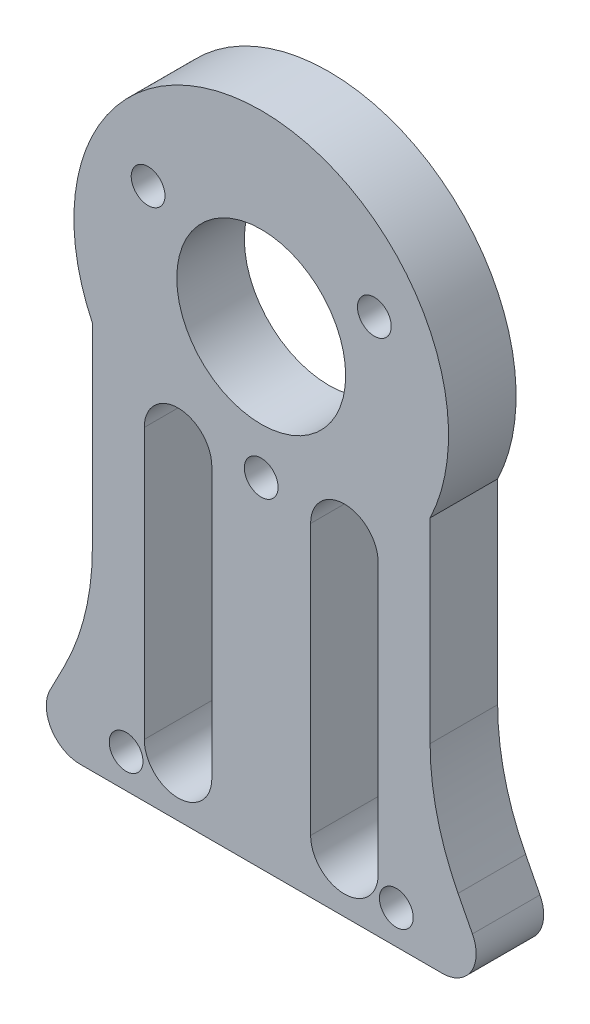
ISO-10303-21;
HEADER;
FILE_DESCRIPTION(('STEP AP214'),'2;1');
FILE_NAME('part.step','',(''),(''),'','','');
FILE_SCHEMA(('AUTOMOTIVE_DESIGN { 1 0 10303 214 1 1 1 1 }'));
ENDSEC;
DATA;
#1=APPLICATION_CONTEXT('core data for automotive mechanical design processes');
#2=APPLICATION_PROTOCOL_DEFINITION('international standard','automotive_design',2000,#1);
#3=PRODUCT_CONTEXT('',#1,'mechanical');
#4=PRODUCT('Part','Part','',(#3));
#5=PRODUCT_RELATED_PRODUCT_CATEGORY('part','',(#4));
#6=PRODUCT_DEFINITION_FORMATION('','',#4);
#7=PRODUCT_DEFINITION_CONTEXT('part definition',#1,'design');
#8=PRODUCT_DEFINITION('design','',#6,#7);
#9=PRODUCT_DEFINITION_SHAPE('','',#8);
#10=(LENGTH_UNIT() NAMED_UNIT(*) SI_UNIT(.MILLI.,.METRE.));
#11=(NAMED_UNIT(*) PLANE_ANGLE_UNIT() SI_UNIT($,.RADIAN.));
#12=(NAMED_UNIT(*) SI_UNIT($,.STERADIAN.) SOLID_ANGLE_UNIT());
#13=UNCERTAINTY_MEASURE_WITH_UNIT(LENGTH_MEASURE(1.E-05),#10,'distance_accuracy_value','');
#14=(GEOMETRIC_REPRESENTATION_CONTEXT(3) GLOBAL_UNCERTAINTY_ASSIGNED_CONTEXT((#13)) GLOBAL_UNIT_ASSIGNED_CONTEXT((#10,
#11,#12)) REPRESENTATION_CONTEXT('',''));
#15=CARTESIAN_POINT('',(0.,0.,0.));
#16=DIRECTION('',(0.,0.,1.));
#17=DIRECTION('',(1.,0.,0.));
#18=AXIS2_PLACEMENT_3D('',#15,#16,#17);
#19=CARTESIAN_POINT('',(0.,0.,4.));
#20=DIRECTION('',(0.,0.,1.));
#21=DIRECTION('',(1.,0.,0.));
#22=AXIS2_PLACEMENT_3D('',#19,#20,#21);
#23=PLANE('',#22);
#24=CARTESIAN_POINT('',(-6.69775198829234,3.86694891340598,4.));
#25=DIRECTION('',(0.,0.,1.));
#26=DIRECTION('',(1.,0.,0.));
#27=AXIS2_PLACEMENT_3D('',#24,#25,#26);
#28=CIRCLE('',#27,1.);
#29=CARTESIAN_POINT('',(-5.69775198829234,3.86694891340598,4.));
#30=VERTEX_POINT('',#29);
#31=EDGE_CURVE('E608',#30,#30,#28,.T.);
#32=ORIENTED_EDGE('',*,*,#31,.F.);
#33=EDGE_LOOP('',(#32));
#34=FACE_BOUND('',#33,.T.);
#35=DIRECTION('',(0.,-1.,0.));
#36=VECTOR('',#35,1.);
#37=CARTESIAN_POINT('',(2.92427415982154,-8.62209810909583,4.));
#38=LINE('',#37,#36);
#39=CARTESIAN_POINT('',(2.92427415982154,-8.62209810909583,4.));
#40=VERTEX_POINT('',#39);
#41=CARTESIAN_POINT('',(2.92427415982153,-24.6220981090958,4.));
#42=VERTEX_POINT('',#41);
#43=EDGE_CURVE('E167',#40,#42,#38,.T.);
#44=ORIENTED_EDGE('',*,*,#43,.F.);
#45=CARTESIAN_POINT('',(4.92427415982154,-8.62209810909583,4.));
#46=DIRECTION('',(0.,0.,1.));
#47=DIRECTION('',(-1.,0.,0.));
#48=AXIS2_PLACEMENT_3D('',#45,#46,#47);
#49=CIRCLE('',#48,2.);
#50=CARTESIAN_POINT('',(6.92427415982154,-8.62209810909583,4.));
#51=VERTEX_POINT('',#50);
#52=EDGE_CURVE('E159',#51,#40,#49,.T.);
#53=ORIENTED_EDGE('',*,*,#52,.F.);
#54=DIRECTION('',(0.,1.,0.));
#55=VECTOR('',#54,1.);
#56=CARTESIAN_POINT('',(6.92427415982154,-8.62209810909583,4.));
#57=LINE('',#56,#55);
#58=CARTESIAN_POINT('',(6.92427415982153,-24.6220981090958,4.));
#59=VERTEX_POINT('',#58);
#60=EDGE_CURVE('E182',#59,#51,#57,.T.);
#61=ORIENTED_EDGE('',*,*,#60,.F.);
#62=CARTESIAN_POINT('',(4.92427415982153,-24.6220981090958,4.));
#63=DIRECTION('',(0.,0.,1.));
#64=DIRECTION('',(-1.,0.,0.));
#65=AXIS2_PLACEMENT_3D('',#62,#63,#64);
#66=CIRCLE('',#65,2.);
#67=EDGE_CURVE('E180',#42,#59,#66,.T.);
#68=ORIENTED_EDGE('',*,*,#67,.F.);
#69=EDGE_LOOP('',(#44,#53,#61,#68));
#70=FACE_BOUND('',#69,.T.);
#71=DIRECTION('',(0.,-1.,0.));
#72=VECTOR('',#71,1.);
#73=CARTESIAN_POINT('',(-6.92427415982154,-8.62209810909583,4.));
#74=LINE('',#73,#72);
#75=CARTESIAN_POINT('',(-6.92427415982154,-8.62209810909583,4.));
#76=VERTEX_POINT('',#75);
#77=CARTESIAN_POINT('',(-6.92427415982153,-24.6220981090958,4.));
#78=VERTEX_POINT('',#77);
#79=EDGE_CURVE('E200',#76,#78,#74,.T.);
#80=ORIENTED_EDGE('',*,*,#79,.F.);
#81=CARTESIAN_POINT('',(-4.92427415982154,-8.62209810909583,4.));
#82=DIRECTION('',(0.,0.,1.));
#83=DIRECTION('',(1.,0.,0.));
#84=AXIS2_PLACEMENT_3D('',#81,#82,#83);
#85=CIRCLE('',#84,2.);
#86=CARTESIAN_POINT('',(-2.92427415982154,-8.62209810909583,4.));
#87=VERTEX_POINT('',#86);
#88=EDGE_CURVE('E198',#87,#76,#85,.T.);
#89=ORIENTED_EDGE('',*,*,#88,.F.);
#90=DIRECTION('',(0.,1.,0.));
#91=VECTOR('',#90,1.);
#92=CARTESIAN_POINT('',(-2.92427415982154,-8.62209810909583,4.));
#93=LINE('',#92,#91);
#94=CARTESIAN_POINT('',(-2.92427415982153,-24.6220981090958,4.));
#95=VERTEX_POINT('',#94);
#96=EDGE_CURVE('E206',#95,#87,#93,.T.);
#97=ORIENTED_EDGE('',*,*,#96,.F.);
#98=CARTESIAN_POINT('',(-4.92427415982153,-24.6220981090958,4.));
#99=DIRECTION('',(0.,0.,1.));
#100=DIRECTION('',(1.,0.,0.));
#101=AXIS2_PLACEMENT_3D('',#98,#99,#100);
#102=CIRCLE('',#101,2.);
#103=EDGE_CURVE('E203',#78,#95,#102,.T.);
#104=ORIENTED_EDGE('',*,*,#103,.F.);
#105=EDGE_LOOP('',(#80,#89,#97,#104));
#106=FACE_BOUND('',#105,.T.);
#107=CARTESIAN_POINT('',(0.,0.,4.));
#108=DIRECTION('',(0.,0.,1.));
#109=DIRECTION('',(1.,0.,0.));
#110=AXIS2_PLACEMENT_3D('',#107,#108,#109);
#111=CIRCLE('',#110,5.);
#112=CARTESIAN_POINT('',(5.,0.,4.));
#113=VERTEX_POINT('',#112);
#114=EDGE_CURVE('E229',#113,#113,#111,.T.);
#115=ORIENTED_EDGE('',*,*,#114,.F.);
#116=EDGE_LOOP('',(#115));
#117=FACE_BOUND('',#116,.T.);
#118=CARTESIAN_POINT('',(-7.99999999999999,-25.7936152189967,4.));
#119=DIRECTION('',(0.,0.,1.));
#120=DIRECTION('',(1.,0.,0.));
#121=AXIS2_PLACEMENT_3D('',#118,#119,#120);
#122=CIRCLE('',#121,1.);
#123=CARTESIAN_POINT('',(-6.99999999999999,-25.7936152189967,4.));
#124=VERTEX_POINT('',#123);
#125=EDGE_CURVE('E241',#124,#124,#122,.T.);
#126=ORIENTED_EDGE('',*,*,#125,.F.);
#127=EDGE_LOOP('',(#126));
#128=FACE_BOUND('',#127,.T.);
#129=CARTESIAN_POINT('',(0.,0.,4.));
#130=DIRECTION('',(0.,0.,1.));
#131=DIRECTION('',(1.,0.,0.));
#132=AXIS2_PLACEMENT_3D('',#129,#130,#131);
#133=CIRCLE('',#132,11.0914566351166);
#134=CARTESIAN_POINT('',(10.,-4.79795897113269,4.));
#135=VERTEX_POINT('',#134);
#136=CARTESIAN_POINT('',(-10.,-4.79795897113268,4.));
#137=VERTEX_POINT('',#136);
#138=EDGE_CURVE('E247',#135,#137,#133,.T.);
#139=ORIENTED_EDGE('',*,*,#138,.T.);
#140=DIRECTION('',(0.,-1.,0.));
#141=VECTOR('',#140,1.);
#142=CARTESIAN_POINT('',(-10.,-4.79795897113268,4.));
#143=LINE('',#142,#141);
#144=CARTESIAN_POINT('',(-10.,-16.3754495893167,4.));
#145=VERTEX_POINT('',#144);
#146=EDGE_CURVE('E250',#137,#145,#143,.T.);
#147=ORIENTED_EDGE('',*,*,#146,.T.);
#148=CARTESIAN_POINT('',(-25.,-16.3754495893167,4.));
#149=DIRECTION('',(0.,0.,-1.));
#150=DIRECTION('',(1.,0.,0.));
#151=AXIS2_PLACEMENT_3D('',#148,#149,#150);
#152=CIRCLE('',#151,15.);
#153=CARTESIAN_POINT('',(-11.6550152440916,-23.2246379985059,4.));
#154=VERTEX_POINT('',#153);
#155=EDGE_CURVE('E253',#145,#154,#152,.T.);
#156=ORIENTED_EDGE('',*,*,#155,.T.);
#157=DIRECTION('',(-0.456612560612616,-0.889665650393894,0.));
#158=VECTOR('',#157,1.);
#159=CARTESIAN_POINT('',(-11.6550152440916,-23.2246379985059,4.));
#160=LINE('',#159,#158);
#161=CARTESIAN_POINT('',(-12.5048144978344,-24.8803900977715,4.));
#162=VERTEX_POINT('',#161);
#163=EDGE_CURVE('E255',#154,#162,#160,.T.);
#164=ORIENTED_EDGE('',*,*,#163,.T.);
#165=CARTESIAN_POINT('',(-10.7254831970466,-25.7936152189967,4.));
#166=DIRECTION('',(0.,0.,1.));
#167=DIRECTION('',(-1.,0.,0.));
#168=AXIS2_PLACEMENT_3D('',#165,#166,#167);
#169=CIRCLE('',#168,2.);
#170=CARTESIAN_POINT('',(-10.7254831970466,-27.7936152189967,4.));
#171=VERTEX_POINT('',#170);
#172=EDGE_CURVE('E257',#162,#171,#169,.T.);
#173=ORIENTED_EDGE('',*,*,#172,.T.);
#174=DIRECTION('',(1.,0.,0.));
#175=VECTOR('',#174,1.);
#176=CARTESIAN_POINT('',(-10.7254831970466,-27.7936152189967,4.));
#177=LINE('',#176,#175);
#178=CARTESIAN_POINT('',(10.7254831970466,-27.7936152189967,4.));
#179=VERTEX_POINT('',#178);
#180=EDGE_CURVE('E259',#171,#179,#177,.T.);
#181=ORIENTED_EDGE('',*,*,#180,.T.);
#182=CARTESIAN_POINT('',(10.7254831970466,-25.7936152189967,4.));
#183=DIRECTION('',(0.,0.,1.));
#184=DIRECTION('',(-1.,0.,0.));
#185=AXIS2_PLACEMENT_3D('',#182,#183,#184);
#186=CIRCLE('',#185,2.);
#187=CARTESIAN_POINT('',(12.5048144978344,-24.8803900977715,4.));
#188=VERTEX_POINT('',#187);
#189=EDGE_CURVE('E261',#179,#188,#186,.T.);
#190=ORIENTED_EDGE('',*,*,#189,.T.);
#191=DIRECTION('',(-0.456612560612619,0.889665650393892,0.));
#192=VECTOR('',#191,1.);
#193=CARTESIAN_POINT('',(12.5048144978344,-24.8803900977715,4.));
#194=LINE('',#193,#192);
#195=CARTESIAN_POINT('',(11.6550152440916,-23.224637998506,4.));
#196=VERTEX_POINT('',#195);
#197=EDGE_CURVE('E263',#188,#196,#194,.T.);
#198=ORIENTED_EDGE('',*,*,#197,.T.);
#199=CARTESIAN_POINT('',(25.,-16.3754495893167,4.));
#200=DIRECTION('',(0.,0.,-1.));
#201=DIRECTION('',(1.,0.,0.));
#202=AXIS2_PLACEMENT_3D('',#199,#200,#201);
#203=CIRCLE('',#202,15.);
#204=CARTESIAN_POINT('',(10.,-16.3754495893167,4.));
#205=VERTEX_POINT('',#204);
#206=EDGE_CURVE('E265',#196,#205,#203,.T.);
#207=ORIENTED_EDGE('',*,*,#206,.T.);
#208=DIRECTION('',(0.,1.,0.));
#209=VECTOR('',#208,1.);
#210=CARTESIAN_POINT('',(10.,-4.79795897113269,4.));
#211=LINE('',#210,#209);
#212=EDGE_CURVE('E267',#205,#135,#211,.T.);
#213=ORIENTED_EDGE('',*,*,#212,.T.);
#214=EDGE_LOOP('',(#139,#147,#156,#164,#173,#181,#190,#198,#207,#213));
#215=FACE_BOUND('',#214,.T.);
#216=CARTESIAN_POINT('',(8.,-25.7936152189967,4.));
#217=DIRECTION('',(0.,0.,1.));
#218=DIRECTION('',(1.,0.,0.));
#219=AXIS2_PLACEMENT_3D('',#216,#217,#218);
#220=CIRCLE('',#219,1.);
#221=CARTESIAN_POINT('',(9.,-25.7936152189967,4.));
#222=VERTEX_POINT('',#221);
#223=EDGE_CURVE('E235',#222,#222,#220,.T.);
#224=ORIENTED_EDGE('',*,*,#223,.F.);
#225=EDGE_LOOP('',(#224));
#226=FACE_BOUND('',#225,.T.);
#227=CARTESIAN_POINT('',(0.,-7.73389782681189,4.));
#228=DIRECTION('',(0.,0.,1.));
#229=DIRECTION('',(1.,0.,0.));
#230=AXIS2_PLACEMENT_3D('',#227,#228,#229);
#231=CIRCLE('',#230,1.);
#232=CARTESIAN_POINT('',(1.,-7.73389782681189,4.));
#233=VERTEX_POINT('',#232);
#234=EDGE_CURVE('E188',#233,#233,#231,.T.);
#235=ORIENTED_EDGE('',*,*,#234,.F.);
#236=EDGE_LOOP('',(#235));
#237=FACE_BOUND('',#236,.T.);
#238=CARTESIAN_POINT('',(6.6977519882924,3.86694891340588,4.));
#239=DIRECTION('',(0.,0.,1.));
#240=DIRECTION('',(1.,0.,0.));
#241=AXIS2_PLACEMENT_3D('',#238,#239,#240);
#242=CIRCLE('',#241,1.);
#243=CARTESIAN_POINT('',(7.6977519882924,3.86694891340588,4.));
#244=VERTEX_POINT('',#243);
#245=EDGE_CURVE('E599',#244,#244,#242,.T.);
#246=ORIENTED_EDGE('',*,*,#245,.F.);
#247=EDGE_LOOP('',(#246));
#248=FACE_BOUND('',#247,.T.);
#249=ADVANCED_FACE('F34',(#34,#70,#106,#117,#128,#215,#226,#237,#248),#23,.T.);
#250=CARTESIAN_POINT('',(0.,0.,0.));
#251=DIRECTION('',(0.,0.,1.));
#252=DIRECTION('',(1.,0.,0.));
#253=AXIS2_PLACEMENT_3D('',#250,#251,#252);
#254=PLANE('',#253);
#255=CARTESIAN_POINT('',(-4.92427415982154,-8.62209810909583,0.));
#256=DIRECTION('',(0.,0.,1.));
#257=DIRECTION('',(1.,0.,0.));
#258=AXIS2_PLACEMENT_3D('',#255,#256,#257);
#259=CIRCLE('',#258,2.);
#260=CARTESIAN_POINT('',(-2.92427415982154,-8.62209810909583,0.));
#261=VERTEX_POINT('',#260);
#262=CARTESIAN_POINT('',(-6.92427415982154,-8.62209810909583,0.));
#263=VERTEX_POINT('',#262);
#264=EDGE_CURVE('E175',#261,#263,#259,.T.);
#265=ORIENTED_EDGE('',*,*,#264,.T.);
#266=DIRECTION('',(0.,-1.,0.));
#267=VECTOR('',#266,1.);
#268=CARTESIAN_POINT('',(-6.92427415982154,-8.62209810909583,0.));
#269=LINE('',#268,#267);
#270=CARTESIAN_POINT('',(-6.92427415982153,-24.6220981090958,0.));
#271=VERTEX_POINT('',#270);
#272=EDGE_CURVE('E211',#263,#271,#269,.T.);
#273=ORIENTED_EDGE('',*,*,#272,.T.);
#274=CARTESIAN_POINT('',(-4.92427415982153,-24.6220981090958,0.));
#275=DIRECTION('',(0.,0.,1.));
#276=DIRECTION('',(1.,0.,0.));
#277=AXIS2_PLACEMENT_3D('',#274,#275,#276);
#278=CIRCLE('',#277,2.);
#279=CARTESIAN_POINT('',(-2.92427415982153,-24.6220981090958,0.));
#280=VERTEX_POINT('',#279);
#281=EDGE_CURVE('E214',#271,#280,#278,.T.);
#282=ORIENTED_EDGE('',*,*,#281,.T.);
#283=DIRECTION('',(0.,1.,0.));
#284=VECTOR('',#283,1.);
#285=CARTESIAN_POINT('',(-2.92427415982154,-8.62209810909583,0.));
#286=LINE('',#285,#284);
#287=EDGE_CURVE('E201',#280,#261,#286,.T.);
#288=ORIENTED_EDGE('',*,*,#287,.T.);
#289=EDGE_LOOP('',(#265,#273,#282,#288));
#290=FACE_BOUND('',#289,.T.);
#291=CARTESIAN_POINT('',(0.,0.,0.));
#292=DIRECTION('',(0.,0.,1.));
#293=DIRECTION('',(1.,0.,0.));
#294=AXIS2_PLACEMENT_3D('',#291,#292,#293);
#295=CIRCLE('',#294,11.0914566351166);
#296=CARTESIAN_POINT('',(10.,-4.79795897113269,0.));
#297=VERTEX_POINT('',#296);
#298=CARTESIAN_POINT('',(-10.,-4.79795897113268,0.));
#299=VERTEX_POINT('',#298);
#300=EDGE_CURVE('E244',#297,#299,#295,.T.);
#301=ORIENTED_EDGE('',*,*,#300,.F.);
#302=DIRECTION('',(0.,1.,0.));
#303=VECTOR('',#302,1.);
#304=CARTESIAN_POINT('',(10.,-4.79795897113269,0.));
#305=LINE('',#304,#303);
#306=CARTESIAN_POINT('',(10.,-16.3754495893167,0.));
#307=VERTEX_POINT('',#306);
#308=EDGE_CURVE('E251',#307,#297,#305,.T.);
#309=ORIENTED_EDGE('',*,*,#308,.F.);
#310=CARTESIAN_POINT('',(25.,-16.3754495893167,0.));
#311=DIRECTION('',(0.,0.,-1.));
#312=DIRECTION('',(1.,0.,0.));
#313=AXIS2_PLACEMENT_3D('',#310,#311,#312);
#314=CIRCLE('',#313,15.);
#315=CARTESIAN_POINT('',(11.6550152440916,-23.224637998506,0.));
#316=VERTEX_POINT('',#315);
#317=EDGE_CURVE('E286',#316,#307,#314,.T.);
#318=ORIENTED_EDGE('',*,*,#317,.F.);
#319=DIRECTION('',(-0.456612560612619,0.889665650393892,0.));
#320=VECTOR('',#319,1.);
#321=CARTESIAN_POINT('',(12.5048144978344,-24.8803900977715,0.));
#322=LINE('',#321,#320);
#323=CARTESIAN_POINT('',(12.5048144978344,-24.8803900977715,0.));
#324=VERTEX_POINT('',#323);
#325=EDGE_CURVE('E284',#324,#316,#322,.T.);
#326=ORIENTED_EDGE('',*,*,#325,.F.);
#327=CARTESIAN_POINT('',(10.7254831970466,-25.7936152189967,0.));
#328=DIRECTION('',(0.,0.,1.));
#329=DIRECTION('',(-1.,0.,0.));
#330=AXIS2_PLACEMENT_3D('',#327,#328,#329);
#331=CIRCLE('',#330,2.);
#332=CARTESIAN_POINT('',(10.7254831970466,-27.7936152189967,0.));
#333=VERTEX_POINT('',#332);
#334=EDGE_CURVE('E282',#333,#324,#331,.T.);
#335=ORIENTED_EDGE('',*,*,#334,.F.);
#336=DIRECTION('',(1.,0.,0.));
#337=VECTOR('',#336,1.);
#338=CARTESIAN_POINT('',(-10.7254831970466,-27.7936152189967,0.));
#339=LINE('',#338,#337);
#340=CARTESIAN_POINT('',(-10.7254831970466,-27.7936152189967,0.));
#341=VERTEX_POINT('',#340);
#342=EDGE_CURVE('E280',#341,#333,#339,.T.);
#343=ORIENTED_EDGE('',*,*,#342,.F.);
#344=CARTESIAN_POINT('',(-10.7254831970466,-25.7936152189967,0.));
#345=DIRECTION('',(0.,0.,1.));
#346=DIRECTION('',(-1.,0.,0.));
#347=AXIS2_PLACEMENT_3D('',#344,#345,#346);
#348=CIRCLE('',#347,2.);
#349=CARTESIAN_POINT('',(-12.5048144978344,-24.8803900977715,0.));
#350=VERTEX_POINT('',#349);
#351=EDGE_CURVE('E278',#350,#341,#348,.T.);
#352=ORIENTED_EDGE('',*,*,#351,.F.);
#353=DIRECTION('',(-0.456612560612616,-0.889665650393894,0.));
#354=VECTOR('',#353,1.);
#355=CARTESIAN_POINT('',(-11.6550152440916,-23.2246379985059,0.));
#356=LINE('',#355,#354);
#357=CARTESIAN_POINT('',(-11.6550152440916,-23.2246379985059,0.));
#358=VERTEX_POINT('',#357);
#359=EDGE_CURVE('E276',#358,#350,#356,.T.);
#360=ORIENTED_EDGE('',*,*,#359,.F.);
#361=CARTESIAN_POINT('',(-25.,-16.3754495893167,0.));
#362=DIRECTION('',(0.,0.,-1.));
#363=DIRECTION('',(1.,0.,0.));
#364=AXIS2_PLACEMENT_3D('',#361,#362,#363);
#365=CIRCLE('',#364,15.);
#366=CARTESIAN_POINT('',(-10.,-16.3754495893167,0.));
#367=VERTEX_POINT('',#366);
#368=EDGE_CURVE('E274',#367,#358,#365,.T.);
#369=ORIENTED_EDGE('',*,*,#368,.F.);
#370=DIRECTION('',(0.,-1.,0.));
#371=VECTOR('',#370,1.);
#372=CARTESIAN_POINT('',(-10.,-4.79795897113268,0.));
#373=LINE('',#372,#371);
#374=EDGE_CURVE('E272',#299,#367,#373,.T.);
#375=ORIENTED_EDGE('',*,*,#374,.F.);
#376=EDGE_LOOP('',(#301,#309,#318,#326,#335,#343,#352,#360,#369,#375));
#377=FACE_BOUND('',#376,.T.);
#378=CARTESIAN_POINT('',(-7.99999999999999,-25.7936152189967,0.));
#379=DIRECTION('',(0.,0.,1.));
#380=DIRECTION('',(1.,0.,0.));
#381=AXIS2_PLACEMENT_3D('',#378,#379,#380);
#382=CIRCLE('',#381,1.);
#383=CARTESIAN_POINT('',(-6.99999999999999,-25.7936152189967,0.));
#384=VERTEX_POINT('',#383);
#385=EDGE_CURVE('E238',#384,#384,#382,.T.);
#386=ORIENTED_EDGE('',*,*,#385,.T.);
#387=EDGE_LOOP('',(#386));
#388=FACE_BOUND('',#387,.T.);
#389=CARTESIAN_POINT('',(8.,-25.7936152189967,0.));
#390=DIRECTION('',(0.,0.,1.));
#391=DIRECTION('',(1.,0.,0.));
#392=AXIS2_PLACEMENT_3D('',#389,#390,#391);
#393=CIRCLE('',#392,1.);
#394=CARTESIAN_POINT('',(9.,-25.7936152189967,0.));
#395=VERTEX_POINT('',#394);
#396=EDGE_CURVE('E232',#395,#395,#393,.T.);
#397=ORIENTED_EDGE('',*,*,#396,.T.);
#398=EDGE_LOOP('',(#397));
#399=FACE_BOUND('',#398,.T.);
#400=CARTESIAN_POINT('',(0.,0.,0.));
#401=DIRECTION('',(0.,0.,1.));
#402=DIRECTION('',(1.,0.,0.));
#403=AXIS2_PLACEMENT_3D('',#400,#401,#402);
#404=CIRCLE('',#403,5.);
#405=CARTESIAN_POINT('',(5.,0.,0.));
#406=VERTEX_POINT('',#405);
#407=EDGE_CURVE('E228',#406,#406,#404,.T.);
#408=ORIENTED_EDGE('',*,*,#407,.T.);
#409=EDGE_LOOP('',(#408));
#410=FACE_BOUND('',#409,.T.);
#411=CARTESIAN_POINT('',(4.92427415982154,-8.62209810909583,0.));
#412=DIRECTION('',(0.,0.,1.));
#413=DIRECTION('',(-1.,0.,0.));
#414=AXIS2_PLACEMENT_3D('',#411,#412,#413);
#415=CIRCLE('',#414,2.);
#416=CARTESIAN_POINT('',(6.92427415982154,-8.62209810909583,0.));
#417=VERTEX_POINT('',#416);
#418=CARTESIAN_POINT('',(2.92427415982154,-8.62209810909583,0.));
#419=VERTEX_POINT('',#418);
#420=EDGE_CURVE('E57',#417,#419,#415,.T.);
#421=ORIENTED_EDGE('',*,*,#420,.T.);
#422=DIRECTION('',(0.,-1.,0.));
#423=VECTOR('',#422,1.);
#424=CARTESIAN_POINT('',(2.92427415982154,-8.62209810909583,0.));
#425=LINE('',#424,#423);
#426=CARTESIAN_POINT('',(2.92427415982153,-24.6220981090958,0.));
#427=VERTEX_POINT('',#426);
#428=EDGE_CURVE('E174',#419,#427,#425,.T.);
#429=ORIENTED_EDGE('',*,*,#428,.T.);
#430=CARTESIAN_POINT('',(4.92427415982153,-24.6220981090958,0.));
#431=DIRECTION('',(0.,0.,1.));
#432=DIRECTION('',(-1.,0.,0.));
#433=AXIS2_PLACEMENT_3D('',#430,#431,#432);
#434=CIRCLE('',#433,2.);
#435=CARTESIAN_POINT('',(6.92427415982153,-24.6220981090958,0.));
#436=VERTEX_POINT('',#435);
#437=EDGE_CURVE('E190',#427,#436,#434,.T.);
#438=ORIENTED_EDGE('',*,*,#437,.T.);
#439=DIRECTION('',(0.,1.,0.));
#440=VECTOR('',#439,1.);
#441=CARTESIAN_POINT('',(6.92427415982154,-8.62209810909583,0.));
#442=LINE('',#441,#440);
#443=EDGE_CURVE('E168',#436,#417,#442,.T.);
#444=ORIENTED_EDGE('',*,*,#443,.T.);
#445=EDGE_LOOP('',(#421,#429,#438,#444));
#446=FACE_BOUND('',#445,.T.);
#447=CARTESIAN_POINT('',(0.,-7.73389782681189,0.));
#448=DIRECTION('',(0.,0.,1.));
#449=DIRECTION('',(1.,0.,0.));
#450=AXIS2_PLACEMENT_3D('',#447,#448,#449);
#451=CIRCLE('',#450,1.);
#452=CARTESIAN_POINT('',(1.,-7.73389782681189,0.));
#453=VERTEX_POINT('',#452);
#454=EDGE_CURVE('E611',#453,#453,#451,.T.);
#455=ORIENTED_EDGE('',*,*,#454,.T.);
#456=EDGE_LOOP('',(#455));
#457=FACE_BOUND('',#456,.T.);
#458=CARTESIAN_POINT('',(-6.69775198829234,3.86694891340598,0.));
#459=DIRECTION('',(0.,0.,1.));
#460=DIRECTION('',(1.,0.,0.));
#461=AXIS2_PLACEMENT_3D('',#458,#459,#460);
#462=CIRCLE('',#461,1.);
#463=CARTESIAN_POINT('',(-5.69775198829234,3.86694891340598,0.));
#464=VERTEX_POINT('',#463);
#465=EDGE_CURVE('E605',#464,#464,#462,.T.);
#466=ORIENTED_EDGE('',*,*,#465,.T.);
#467=EDGE_LOOP('',(#466));
#468=FACE_BOUND('',#467,.T.);
#469=CARTESIAN_POINT('',(6.6977519882924,3.86694891340588,0.));
#470=DIRECTION('',(0.,0.,1.));
#471=DIRECTION('',(1.,0.,0.));
#472=AXIS2_PLACEMENT_3D('',#469,#470,#471);
#473=CIRCLE('',#472,1.);
#474=CARTESIAN_POINT('',(7.6977519882924,3.86694891340588,0.));
#475=VERTEX_POINT('',#474);
#476=EDGE_CURVE('E602',#475,#475,#473,.T.);
#477=ORIENTED_EDGE('',*,*,#476,.T.);
#478=EDGE_LOOP('',(#477));
#479=FACE_BOUND('',#478,.T.);
#480=ADVANCED_FACE('F322',(#290,#377,#388,#399,#410,#446,#457,#468,#479),#254,.F.);
#481=CARTESIAN_POINT('',(0.,0.,4.));
#482=DIRECTION('',(0.,0.,-1.));
#483=DIRECTION('',(-1.,0.,0.));
#484=AXIS2_PLACEMENT_3D('',#481,#482,#483);
#485=CYLINDRICAL_SURFACE('',#484,11.0914566351166);
#486=ORIENTED_EDGE('',*,*,#300,.T.);
#487=DIRECTION('',(0.,0.,-1.));
#488=VECTOR('',#487,1.);
#489=CARTESIAN_POINT('',(-10.,-4.79795897113268,4.));
#490=LINE('',#489,#488);
#491=EDGE_CURVE('E11',#137,#299,#490,.T.);
#492=ORIENTED_EDGE('',*,*,#491,.F.);
#493=ORIENTED_EDGE('',*,*,#138,.F.);
#494=DIRECTION('',(0.,0.,-1.));
#495=VECTOR('',#494,1.);
#496=CARTESIAN_POINT('',(10.,-4.79795897113269,4.));
#497=LINE('',#496,#495);
#498=EDGE_CURVE('E269',#135,#297,#497,.T.);
#499=ORIENTED_EDGE('',*,*,#498,.T.);
#500=EDGE_LOOP('',(#486,#492,#493,#499));
#501=FACE_BOUND('',#500,.T.);
#502=ADVANCED_FACE('F36',(#501),#485,.T.);
#503=CARTESIAN_POINT('',(-10.,-4.79795897113268,4.));
#504=DIRECTION('',(1.,0.,0.));
#505=DIRECTION('',(0.,0.,-1.));
#506=AXIS2_PLACEMENT_3D('',#503,#504,#505);
#507=PLANE('',#506);
#508=ORIENTED_EDGE('',*,*,#374,.T.);
#509=DIRECTION('',(0.,0.,-1.));
#510=VECTOR('',#509,1.);
#511=CARTESIAN_POINT('',(-10.,-16.3754495893167,4.));
#512=LINE('',#511,#510);
#513=EDGE_CURVE('E42',#145,#367,#512,.T.);
#514=ORIENTED_EDGE('',*,*,#513,.F.);
#515=ORIENTED_EDGE('',*,*,#146,.F.);
#516=ORIENTED_EDGE('',*,*,#491,.T.);
#517=EDGE_LOOP('',(#508,#514,#515,#516));
#518=FACE_BOUND('',#517,.T.);
#519=ADVANCED_FACE('F340',(#518),#507,.F.);
#520=CARTESIAN_POINT('',(-25.,-16.3754495893167,4.));
#521=DIRECTION('',(0.,0.,-1.));
#522=DIRECTION('',(-1.,0.,0.));
#523=AXIS2_PLACEMENT_3D('',#520,#521,#522);
#524=CYLINDRICAL_SURFACE('',#523,15.);
#525=ORIENTED_EDGE('',*,*,#368,.T.);
#526=DIRECTION('',(0.,0.,-1.));
#527=VECTOR('',#526,1.);
#528=CARTESIAN_POINT('',(-11.6550152440916,-23.2246379985059,4.));
#529=LINE('',#528,#527);
#530=EDGE_CURVE('E309',#154,#358,#529,.T.);
#531=ORIENTED_EDGE('',*,*,#530,.F.);
#532=ORIENTED_EDGE('',*,*,#155,.F.);
#533=ORIENTED_EDGE('',*,*,#513,.T.);
#534=EDGE_LOOP('',(#525,#531,#532,#533));
#535=FACE_BOUND('',#534,.T.);
#536=ADVANCED_FACE('F316',(#535),#524,.F.);
#537=CARTESIAN_POINT('',(-11.6550152440916,-23.2246379985059,4.));
#538=DIRECTION('',(0.889665650393894,-0.456612560612616,0.));
#539=DIRECTION('',(0.456612560612616,0.889665650393894,0.));
#540=AXIS2_PLACEMENT_3D('',#537,#538,#539);
#541=PLANE('',#540);
#542=ORIENTED_EDGE('',*,*,#359,.T.);
#543=DIRECTION('',(0.,0.,-1.));
#544=VECTOR('',#543,1.);
#545=CARTESIAN_POINT('',(-12.5048144978344,-24.8803900977715,4.));
#546=LINE('',#545,#544);
#547=EDGE_CURVE('E306',#162,#350,#546,.T.);
#548=ORIENTED_EDGE('',*,*,#547,.F.);
#549=ORIENTED_EDGE('',*,*,#163,.F.);
#550=ORIENTED_EDGE('',*,*,#530,.T.);
#551=EDGE_LOOP('',(#542,#548,#549,#550));
#552=FACE_BOUND('',#551,.T.);
#553=ADVANCED_FACE('F328',(#552),#541,.F.);
#554=CARTESIAN_POINT('',(-10.7254831970466,-25.7936152189967,4.));
#555=DIRECTION('',(0.,0.,-1.));
#556=DIRECTION('',(-1.,0.,0.));
#557=AXIS2_PLACEMENT_3D('',#554,#555,#556);
#558=CYLINDRICAL_SURFACE('',#557,2.);
#559=ORIENTED_EDGE('',*,*,#351,.T.);
#560=DIRECTION('',(0.,0.,-1.));
#561=VECTOR('',#560,1.);
#562=CARTESIAN_POINT('',(-10.7254831970466,-27.7936152189967,4.));
#563=LINE('',#562,#561);
#564=EDGE_CURVE('E303',#171,#341,#563,.T.);
#565=ORIENTED_EDGE('',*,*,#564,.F.);
#566=ORIENTED_EDGE('',*,*,#172,.F.);
#567=ORIENTED_EDGE('',*,*,#547,.T.);
#568=EDGE_LOOP('',(#559,#565,#566,#567));
#569=FACE_BOUND('',#568,.T.);
#570=ADVANCED_FACE('F332',(#569),#558,.T.);
#571=CARTESIAN_POINT('',(-10.7254831970466,-27.7936152189967,4.));
#572=DIRECTION('',(0.,1.,0.));
#573=DIRECTION('',(0.,0.,1.));
#574=AXIS2_PLACEMENT_3D('',#571,#572,#573);
#575=PLANE('',#574);
#576=ORIENTED_EDGE('',*,*,#342,.T.);
#577=DIRECTION('',(0.,0.,-1.));
#578=VECTOR('',#577,1.);
#579=CARTESIAN_POINT('',(10.7254831970466,-27.7936152189967,4.));
#580=LINE('',#579,#578);
#581=EDGE_CURVE('E300',#179,#333,#580,.T.);
#582=ORIENTED_EDGE('',*,*,#581,.F.);
#583=ORIENTED_EDGE('',*,*,#180,.F.);
#584=ORIENTED_EDGE('',*,*,#564,.T.);
#585=EDGE_LOOP('',(#576,#582,#583,#584));
#586=FACE_BOUND('',#585,.T.);
#587=ADVANCED_FACE('F363',(#586),#575,.F.);
#588=CARTESIAN_POINT('',(10.7254831970466,-25.7936152189967,4.));
#589=DIRECTION('',(0.,0.,-1.));
#590=DIRECTION('',(-1.,0.,0.));
#591=AXIS2_PLACEMENT_3D('',#588,#589,#590);
#592=CYLINDRICAL_SURFACE('',#591,2.);
#593=ORIENTED_EDGE('',*,*,#334,.T.);
#594=DIRECTION('',(0.,0.,-1.));
#595=VECTOR('',#594,1.);
#596=CARTESIAN_POINT('',(12.5048144978344,-24.8803900977715,4.));
#597=LINE('',#596,#595);
#598=EDGE_CURVE('E297',#188,#324,#597,.T.);
#599=ORIENTED_EDGE('',*,*,#598,.F.);
#600=ORIENTED_EDGE('',*,*,#189,.F.);
#601=ORIENTED_EDGE('',*,*,#581,.T.);
#602=EDGE_LOOP('',(#593,#599,#600,#601));
#603=FACE_BOUND('',#602,.T.);
#604=ADVANCED_FACE('F360',(#603),#592,.T.);
#605=CARTESIAN_POINT('',(12.5048144978344,-24.8803900977715,4.));
#606=DIRECTION('',(-0.889665650393893,-0.456612560612619,0.));
#607=DIRECTION('',(0.456612560612619,-0.889665650393893,0.));
#608=AXIS2_PLACEMENT_3D('',#605,#606,#607);
#609=PLANE('',#608);
#610=ORIENTED_EDGE('',*,*,#325,.T.);
#611=DIRECTION('',(0.,0.,-1.));
#612=VECTOR('',#611,1.);
#613=CARTESIAN_POINT('',(11.6550152440916,-23.224637998506,4.));
#614=LINE('',#613,#612);
#615=EDGE_CURVE('E294',#196,#316,#614,.T.);
#616=ORIENTED_EDGE('',*,*,#615,.F.);
#617=ORIENTED_EDGE('',*,*,#197,.F.);
#618=ORIENTED_EDGE('',*,*,#598,.T.);
#619=EDGE_LOOP('',(#610,#616,#617,#618));
#620=FACE_BOUND('',#619,.T.);
#621=ADVANCED_FACE('F356',(#620),#609,.F.);
#622=CARTESIAN_POINT('',(25.,-16.3754495893167,4.));
#623=DIRECTION('',(0.,0.,-1.));
#624=DIRECTION('',(-1.,0.,0.));
#625=AXIS2_PLACEMENT_3D('',#622,#623,#624);
#626=CYLINDRICAL_SURFACE('',#625,15.);
#627=ORIENTED_EDGE('',*,*,#317,.T.);
#628=DIRECTION('',(0.,0.,-1.));
#629=VECTOR('',#628,1.);
#630=CARTESIAN_POINT('',(10.,-16.3754495893167,4.));
#631=LINE('',#630,#629);
#632=EDGE_CURVE('E291',#205,#307,#631,.T.);
#633=ORIENTED_EDGE('',*,*,#632,.F.);
#634=ORIENTED_EDGE('',*,*,#206,.F.);
#635=ORIENTED_EDGE('',*,*,#615,.T.);
#636=EDGE_LOOP('',(#627,#633,#634,#635));
#637=FACE_BOUND('',#636,.T.);
#638=ADVANCED_FACE('F352',(#637),#626,.F.);
#639=CARTESIAN_POINT('',(10.,-4.79795897113269,4.));
#640=DIRECTION('',(-1.,0.,0.));
#641=DIRECTION('',(0.,-1.,0.));
#642=AXIS2_PLACEMENT_3D('',#639,#640,#641);
#643=PLANE('',#642);
#644=ORIENTED_EDGE('',*,*,#308,.T.);
#645=ORIENTED_EDGE('',*,*,#498,.F.);
#646=ORIENTED_EDGE('',*,*,#212,.F.);
#647=ORIENTED_EDGE('',*,*,#632,.T.);
#648=EDGE_LOOP('',(#644,#645,#646,#647));
#649=FACE_BOUND('',#648,.T.);
#650=ADVANCED_FACE('F347',(#649),#643,.F.);
#651=CARTESIAN_POINT('',(-7.99999999999999,-25.7936152189967,4.));
#652=DIRECTION('',(0.,0.,-1.));
#653=DIRECTION('',(-1.,0.,0.));
#654=AXIS2_PLACEMENT_3D('',#651,#652,#653);
#655=CYLINDRICAL_SURFACE('',#654,1.);
#656=ORIENTED_EDGE('',*,*,#125,.T.);
#657=EDGE_LOOP('',(#656));
#658=FACE_BOUND('',#657,.T.);
#659=ORIENTED_EDGE('',*,*,#385,.F.);
#660=EDGE_LOOP('',(#659));
#661=FACE_BOUND('',#660,.T.);
#662=ADVANCED_FACE('F382',(#658,#661),#655,.F.);
#663=CARTESIAN_POINT('',(8.,-25.7936152189967,4.));
#664=DIRECTION('',(0.,0.,-1.));
#665=DIRECTION('',(-1.,0.,0.));
#666=AXIS2_PLACEMENT_3D('',#663,#664,#665);
#667=CYLINDRICAL_SURFACE('',#666,1.);
#668=ORIENTED_EDGE('',*,*,#223,.T.);
#669=EDGE_LOOP('',(#668));
#670=FACE_BOUND('',#669,.T.);
#671=ORIENTED_EDGE('',*,*,#396,.F.);
#672=EDGE_LOOP('',(#671));
#673=FACE_BOUND('',#672,.T.);
#674=ADVANCED_FACE('F408',(#670,#673),#667,.F.);
#675=CARTESIAN_POINT('',(0.,0.,4.));
#676=DIRECTION('',(0.,0.,-1.));
#677=DIRECTION('',(-1.,0.,0.));
#678=AXIS2_PLACEMENT_3D('',#675,#676,#677);
#679=CYLINDRICAL_SURFACE('',#678,5.);
#680=ORIENTED_EDGE('',*,*,#114,.T.);
#681=EDGE_LOOP('',(#680));
#682=FACE_BOUND('',#681,.T.);
#683=ORIENTED_EDGE('',*,*,#407,.F.);
#684=EDGE_LOOP('',(#683));
#685=FACE_BOUND('',#684,.T.);
#686=ADVANCED_FACE('F415',(#682,#685),#679,.F.);
#687=CARTESIAN_POINT('',(-4.92427415982154,-8.62209810909583,4.));
#688=DIRECTION('',(0.,0.,-1.));
#689=DIRECTION('',(-1.,0.,0.));
#690=AXIS2_PLACEMENT_3D('',#687,#688,#689);
#691=CYLINDRICAL_SURFACE('',#690,2.);
#692=ORIENTED_EDGE('',*,*,#264,.F.);
#693=DIRECTION('',(0.,0.,-1.));
#694=VECTOR('',#693,1.);
#695=CARTESIAN_POINT('',(-2.92427415982154,-8.62209810909583,4.));
#696=LINE('',#695,#694);
#697=EDGE_CURVE('E208',#87,#261,#696,.T.);
#698=ORIENTED_EDGE('',*,*,#697,.F.);
#699=ORIENTED_EDGE('',*,*,#88,.T.);
#700=DIRECTION('',(0.,0.,-1.));
#701=VECTOR('',#700,1.);
#702=CARTESIAN_POINT('',(-6.92427415982154,-8.62209810909583,4.));
#703=LINE('',#702,#701);
#704=EDGE_CURVE('E225',#76,#263,#703,.T.);
#705=ORIENTED_EDGE('',*,*,#704,.T.);
#706=EDGE_LOOP('',(#692,#698,#699,#705));
#707=FACE_BOUND('',#706,.T.);
#708=ADVANCED_FACE('F422',(#707),#691,.F.);
#709=CARTESIAN_POINT('',(-6.92427415982154,-8.62209810909583,4.));
#710=DIRECTION('',(1.,0.,0.));
#711=DIRECTION('',(0.,1.,0.));
#712=AXIS2_PLACEMENT_3D('',#709,#710,#711);
#713=PLANE('',#712);
#714=ORIENTED_EDGE('',*,*,#272,.F.);
#715=ORIENTED_EDGE('',*,*,#704,.F.);
#716=ORIENTED_EDGE('',*,*,#79,.T.);
#717=DIRECTION('',(0.,0.,-1.));
#718=VECTOR('',#717,1.);
#719=CARTESIAN_POINT('',(-6.92427415982153,-24.6220981090958,4.));
#720=LINE('',#719,#718);
#721=EDGE_CURVE('E223',#78,#271,#720,.T.);
#722=ORIENTED_EDGE('',*,*,#721,.T.);
#723=EDGE_LOOP('',(#714,#715,#716,#722));
#724=FACE_BOUND('',#723,.T.);
#725=ADVANCED_FACE('F430',(#724),#713,.T.);
#726=CARTESIAN_POINT('',(-4.92427415982153,-24.6220981090958,4.));
#727=DIRECTION('',(0.,0.,-1.));
#728=DIRECTION('',(-1.,0.,0.));
#729=AXIS2_PLACEMENT_3D('',#726,#727,#728);
#730=CYLINDRICAL_SURFACE('',#729,2.);
#731=ORIENTED_EDGE('',*,*,#281,.F.);
#732=ORIENTED_EDGE('',*,*,#721,.F.);
#733=ORIENTED_EDGE('',*,*,#103,.T.);
#734=DIRECTION('',(0.,0.,-1.));
#735=VECTOR('',#734,1.);
#736=CARTESIAN_POINT('',(-2.92427415982153,-24.6220981090958,4.));
#737=LINE('',#736,#735);
#738=EDGE_CURVE('E221',#95,#280,#737,.T.);
#739=ORIENTED_EDGE('',*,*,#738,.T.);
#740=EDGE_LOOP('',(#731,#732,#733,#739));
#741=FACE_BOUND('',#740,.T.);
#742=ADVANCED_FACE('F438',(#741),#730,.F.);
#743=CARTESIAN_POINT('',(-2.92427415982154,-8.62209810909583,4.));
#744=DIRECTION('',(-1.,0.,0.));
#745=DIRECTION('',(0.,-1.,0.));
#746=AXIS2_PLACEMENT_3D('',#743,#744,#745);
#747=PLANE('',#746);
#748=ORIENTED_EDGE('',*,*,#287,.F.);
#749=ORIENTED_EDGE('',*,*,#738,.F.);
#750=ORIENTED_EDGE('',*,*,#96,.T.);
#751=ORIENTED_EDGE('',*,*,#697,.T.);
#752=EDGE_LOOP('',(#748,#749,#750,#751));
#753=FACE_BOUND('',#752,.T.);
#754=ADVANCED_FACE('F446',(#753),#747,.T.);
#755=CARTESIAN_POINT('',(4.92427415982154,-8.62209810909583,4.));
#756=DIRECTION('',(0.,0.,-1.));
#757=DIRECTION('',(-1.,0.,0.));
#758=AXIS2_PLACEMENT_3D('',#755,#756,#757);
#759=CYLINDRICAL_SURFACE('',#758,2.);
#760=ORIENTED_EDGE('',*,*,#420,.F.);
#761=DIRECTION('',(0.,0.,-1.));
#762=VECTOR('',#761,1.);
#763=CARTESIAN_POINT('',(6.92427415982154,-8.62209810909583,4.));
#764=LINE('',#763,#762);
#765=EDGE_CURVE('E163',#51,#417,#764,.T.);
#766=ORIENTED_EDGE('',*,*,#765,.F.);
#767=ORIENTED_EDGE('',*,*,#52,.T.);
#768=DIRECTION('',(0.,0.,-1.));
#769=VECTOR('',#768,1.);
#770=CARTESIAN_POINT('',(2.92427415982154,-8.62209810909583,4.));
#771=LINE('',#770,#769);
#772=EDGE_CURVE('E162',#40,#419,#771,.T.);
#773=ORIENTED_EDGE('',*,*,#772,.T.);
#774=EDGE_LOOP('',(#760,#766,#767,#773));
#775=FACE_BOUND('',#774,.T.);
#776=ADVANCED_FACE('F161',(#775),#759,.F.);
#777=CARTESIAN_POINT('',(2.92427415982154,-8.62209810909583,4.));
#778=DIRECTION('',(1.,0.,0.));
#779=DIRECTION('',(0.,1.,0.));
#780=AXIS2_PLACEMENT_3D('',#777,#778,#779);
#781=PLANE('',#780);
#782=ORIENTED_EDGE('',*,*,#428,.F.);
#783=ORIENTED_EDGE('',*,*,#772,.F.);
#784=ORIENTED_EDGE('',*,*,#43,.T.);
#785=DIRECTION('',(0.,0.,-1.));
#786=VECTOR('',#785,1.);
#787=CARTESIAN_POINT('',(2.92427415982153,-24.6220981090958,4.));
#788=LINE('',#787,#786);
#789=EDGE_CURVE('E176',#42,#427,#788,.T.);
#790=ORIENTED_EDGE('',*,*,#789,.T.);
#791=EDGE_LOOP('',(#782,#783,#784,#790));
#792=FACE_BOUND('',#791,.T.);
#793=ADVANCED_FACE('F171',(#792),#781,.T.);
#794=CARTESIAN_POINT('',(4.92427415982153,-24.6220981090958,4.));
#795=DIRECTION('',(0.,0.,-1.));
#796=DIRECTION('',(-1.,0.,0.));
#797=AXIS2_PLACEMENT_3D('',#794,#795,#796);
#798=CYLINDRICAL_SURFACE('',#797,2.);
#799=ORIENTED_EDGE('',*,*,#437,.F.);
#800=ORIENTED_EDGE('',*,*,#789,.F.);
#801=ORIENTED_EDGE('',*,*,#67,.T.);
#802=DIRECTION('',(0.,0.,-1.));
#803=VECTOR('',#802,1.);
#804=CARTESIAN_POINT('',(6.92427415982153,-24.6220981090958,4.));
#805=LINE('',#804,#803);
#806=EDGE_CURVE('E49',#59,#436,#805,.T.);
#807=ORIENTED_EDGE('',*,*,#806,.T.);
#808=EDGE_LOOP('',(#799,#800,#801,#807));
#809=FACE_BOUND('',#808,.T.);
#810=ADVANCED_FACE('F467',(#809),#798,.F.);
#811=CARTESIAN_POINT('',(6.92427415982154,-8.62209810909583,4.));
#812=DIRECTION('',(-1.,0.,0.));
#813=DIRECTION('',(0.,-1.,0.));
#814=AXIS2_PLACEMENT_3D('',#811,#812,#813);
#815=PLANE('',#814);
#816=ORIENTED_EDGE('',*,*,#443,.F.);
#817=ORIENTED_EDGE('',*,*,#806,.F.);
#818=ORIENTED_EDGE('',*,*,#60,.T.);
#819=ORIENTED_EDGE('',*,*,#765,.T.);
#820=EDGE_LOOP('',(#816,#817,#818,#819));
#821=FACE_BOUND('',#820,.T.);
#822=ADVANCED_FACE('F474',(#821),#815,.T.);
#823=CARTESIAN_POINT('',(0.,-7.73389782681189,4.));
#824=DIRECTION('',(0.,0.,-1.));
#825=DIRECTION('',(-1.,0.,0.));
#826=AXIS2_PLACEMENT_3D('',#823,#824,#825);
#827=CYLINDRICAL_SURFACE('',#826,1.);
#828=ORIENTED_EDGE('',*,*,#234,.T.);
#829=EDGE_LOOP('',(#828));
#830=FACE_BOUND('',#829,.T.);
#831=ORIENTED_EDGE('',*,*,#454,.F.);
#832=EDGE_LOOP('',(#831));
#833=FACE_BOUND('',#832,.T.);
#834=ADVANCED_FACE('F482',(#830,#833),#827,.F.);
#835=CARTESIAN_POINT('',(-6.69775198829234,3.86694891340598,4.));
#836=DIRECTION('',(0.,0.,-1.));
#837=DIRECTION('',(-1.,0.,0.));
#838=AXIS2_PLACEMENT_3D('',#835,#836,#837);
#839=CYLINDRICAL_SURFACE('',#838,1.);
#840=ORIENTED_EDGE('',*,*,#31,.T.);
#841=EDGE_LOOP('',(#840));
#842=FACE_BOUND('',#841,.T.);
#843=ORIENTED_EDGE('',*,*,#465,.F.);
#844=EDGE_LOOP('',(#843));
#845=FACE_BOUND('',#844,.T.);
#846=ADVANCED_FACE('F489',(#842,#845),#839,.F.);
#847=CARTESIAN_POINT('',(6.6977519882924,3.86694891340588,4.));
#848=DIRECTION('',(0.,0.,-1.));
#849=DIRECTION('',(-1.,0.,0.));
#850=AXIS2_PLACEMENT_3D('',#847,#848,#849);
#851=CYLINDRICAL_SURFACE('',#850,1.);
#852=ORIENTED_EDGE('',*,*,#245,.T.);
#853=EDGE_LOOP('',(#852));
#854=FACE_BOUND('',#853,.T.);
#855=ORIENTED_EDGE('',*,*,#476,.F.);
#856=EDGE_LOOP('',(#855));
#857=FACE_BOUND('',#856,.T.);
#858=ADVANCED_FACE('F497',(#854,#857),#851,.F.);
#859=CLOSED_SHELL('',(#249,#480,#502,#519,#536,#553,#570,#587,#604,#621,#638,#650,#662,#674,
#686,#708,#725,#742,#754,#776,#793,#810,#822,#834,#846,#858));
#860=MANIFOLD_SOLID_BREP('B2',#859);
#861=ADVANCED_BREP_SHAPE_REPRESENTATION('',(#18,#860),#14);
#862=SHAPE_DEFINITION_REPRESENTATION(#9,#861);
ENDSEC;
END-ISO-10303-21;
